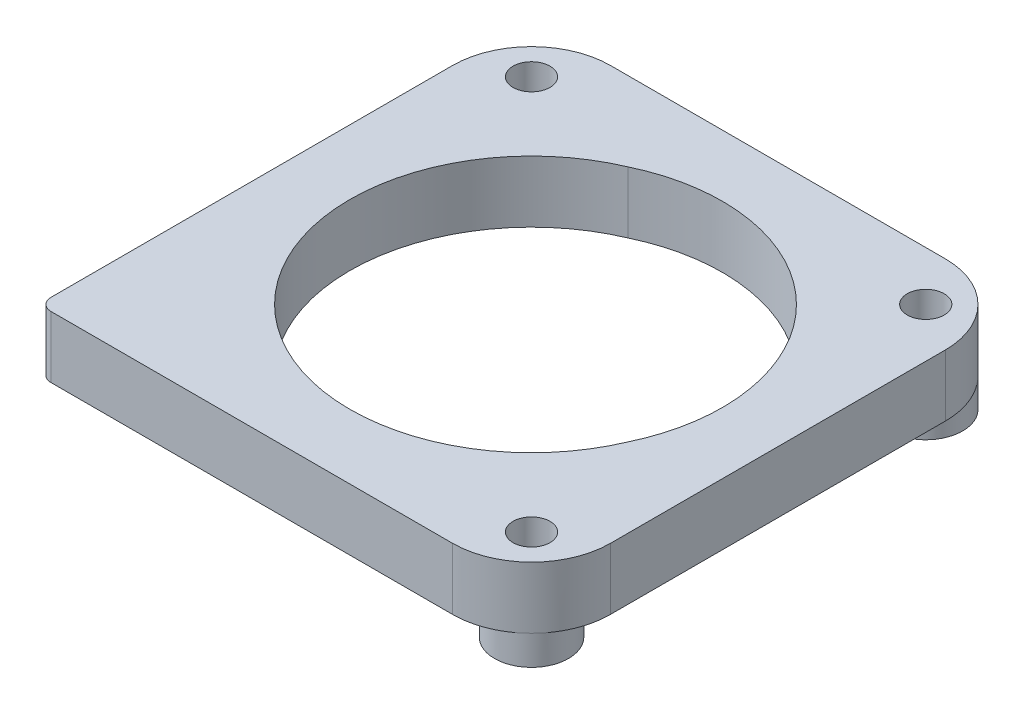
ISO-10303-21;
HEADER;
FILE_DESCRIPTION(('STEP AP214'),'2;1');
FILE_NAME('part.step','',(''),(''),'','','');
FILE_SCHEMA(('AUTOMOTIVE_DESIGN { 1 0 10303 214 1 1 1 1 }'));
ENDSEC;
DATA;
#1=APPLICATION_CONTEXT('core data for automotive mechanical design processes');
#2=APPLICATION_PROTOCOL_DEFINITION('international standard','automotive_design',2000,#1);
#3=PRODUCT_CONTEXT('',#1,'mechanical');
#4=PRODUCT('Part','Part','',(#3));
#5=PRODUCT_RELATED_PRODUCT_CATEGORY('part','',(#4));
#6=PRODUCT_DEFINITION_FORMATION('','',#4);
#7=PRODUCT_DEFINITION_CONTEXT('part definition',#1,'design');
#8=PRODUCT_DEFINITION('design','',#6,#7);
#9=PRODUCT_DEFINITION_SHAPE('','',#8);
#10=(LENGTH_UNIT() NAMED_UNIT(*) SI_UNIT(.MILLI.,.METRE.));
#11=(NAMED_UNIT(*) PLANE_ANGLE_UNIT() SI_UNIT($,.RADIAN.));
#12=(NAMED_UNIT(*) SI_UNIT($,.STERADIAN.) SOLID_ANGLE_UNIT());
#13=UNCERTAINTY_MEASURE_WITH_UNIT(LENGTH_MEASURE(1.E-05),#10,'distance_accuracy_value','');
#14=(GEOMETRIC_REPRESENTATION_CONTEXT(3) GLOBAL_UNCERTAINTY_ASSIGNED_CONTEXT((#13)) GLOBAL_UNIT_ASSIGNED_CONTEXT((#10,
#11,#12)) REPRESENTATION_CONTEXT('',''));
#15=CARTESIAN_POINT('',(0.,0.,0.));
#16=DIRECTION('',(0.,0.,1.));
#17=DIRECTION('',(1.,0.,0.));
#18=AXIS2_PLACEMENT_3D('',#15,#16,#17);
#19=CARTESIAN_POINT('',(0.500000000000007,20.,-0.5));
#20=DIRECTION('',(0.,-1.,0.));
#21=DIRECTION('',(0.,0.,-1.));
#22=AXIS2_PLACEMENT_3D('',#19,#20,#21);
#23=CYLINDRICAL_SURFACE('',#22,14.5);
#24=CARTESIAN_POINT('',(0.500000000000007,15.,-0.5));
#25=DIRECTION('',(0.,1.,0.));
#26=DIRECTION('',(0.,0.,1.));
#27=AXIS2_PLACEMENT_3D('',#24,#25,#26);
#28=CIRCLE('',#27,14.5);
#29=CARTESIAN_POINT('',(13.5769511605932,15.,5.76445116059336));
#30=VERTEX_POINT('',#29);
#31=CARTESIAN_POINT('',(-5.76445116059317,15.,-13.5769511605933));
#32=VERTEX_POINT('',#31);
#33=EDGE_CURVE('E197',#30,#32,#28,.T.);
#34=ORIENTED_EDGE('',*,*,#33,.F.);
#35=DIRECTION('',(0.,-1.,0.));
#36=VECTOR('',#35,1.);
#37=CARTESIAN_POINT('',(13.5769511605932,20.,5.76445116059336));
#38=LINE('',#37,#36);
#39=CARTESIAN_POINT('',(13.5769511605932,20.,5.76445116059336));
#40=VERTEX_POINT('',#39);
#41=EDGE_CURVE('E11',#40,#30,#38,.T.);
#42=ORIENTED_EDGE('',*,*,#41,.F.);
#43=CARTESIAN_POINT('',(0.500000000000007,20.,-0.5));
#44=DIRECTION('',(0.,1.,0.));
#45=DIRECTION('',(0.,0.,1.));
#46=AXIS2_PLACEMENT_3D('',#43,#44,#45);
#47=CIRCLE('',#46,14.5);
#48=CARTESIAN_POINT('',(-5.76445116059317,20.,-13.5769511605933));
#49=VERTEX_POINT('',#48);
#50=EDGE_CURVE('E161',#40,#49,#47,.T.);
#51=ORIENTED_EDGE('',*,*,#50,.T.);
#52=DIRECTION('',(0.,-1.,0.));
#53=VECTOR('',#52,1.);
#54=CARTESIAN_POINT('',(-5.76445116059317,20.,-13.5769511605933));
#55=LINE('',#54,#53);
#56=EDGE_CURVE('E57',#49,#32,#55,.T.);
#57=ORIENTED_EDGE('',*,*,#56,.T.);
#58=EDGE_LOOP('',(#34,#42,#51,#57));
#59=FACE_BOUND('',#58,.T.);
#60=ADVANCED_FACE('F47',(#59),#23,.F.);
#61=CARTESIAN_POINT('',(0.,20.,-20.));
#62=DIRECTION('',(0.,0.,1.));
#63=DIRECTION('',(1.,0.,0.));
#64=AXIS2_PLACEMENT_3D('',#61,#62,#63);
#65=PLANE('',#64);
#66=DIRECTION('',(-1.,0.,0.));
#67=VECTOR('',#66,1.);
#68=CARTESIAN_POINT('',(0.,15.,-20.));
#69=LINE('',#68,#67);
#70=CARTESIAN_POINT('',(13.5857864376269,15.,-20.));
#71=VERTEX_POINT('',#70);
#72=CARTESIAN_POINT('',(-13.5857864376269,15.,-20.));
#73=VERTEX_POINT('',#72);
#74=EDGE_CURVE('E174',#71,#73,#69,.T.);
#75=ORIENTED_EDGE('',*,*,#74,.T.);
#76=DIRECTION('',(0.,-1.,0.));
#77=VECTOR('',#76,1.);
#78=CARTESIAN_POINT('',(-13.5857864376269,20.,-20.));
#79=LINE('',#78,#77);
#80=CARTESIAN_POINT('',(-13.5857864376269,20.,-20.));
#81=VERTEX_POINT('',#80);
#82=EDGE_CURVE('E51',#81,#73,#79,.T.);
#83=ORIENTED_EDGE('',*,*,#82,.F.);
#84=DIRECTION('',(-1.,0.,0.));
#85=VECTOR('',#84,1.);
#86=CARTESIAN_POINT('',(0.,20.,-20.));
#87=LINE('',#86,#85);
#88=CARTESIAN_POINT('',(13.5857864376269,20.,-20.));
#89=VERTEX_POINT('',#88);
#90=EDGE_CURVE('E112',#89,#81,#87,.T.);
#91=ORIENTED_EDGE('',*,*,#90,.F.);
#92=DIRECTION('',(0.,-1.,0.));
#93=VECTOR('',#92,1.);
#94=CARTESIAN_POINT('',(13.5857864376269,20.,-20.));
#95=LINE('',#94,#93);
#96=EDGE_CURVE('E137',#89,#71,#95,.T.);
#97=ORIENTED_EDGE('',*,*,#96,.T.);
#98=EDGE_LOOP('',(#75,#83,#91,#97));
#99=FACE_BOUND('',#98,.T.);
#100=ADVANCED_FACE('F150',(#99),#65,.F.);
#101=CARTESIAN_POINT('',(-13.5857864376269,20.,-13.5857864376269));
#102=DIRECTION('',(0.,-1.,0.));
#103=DIRECTION('',(0.,0.,-1.));
#104=AXIS2_PLACEMENT_3D('',#101,#102,#103);
#105=CYLINDRICAL_SURFACE('',#104,6.4142135623731);
#106=CARTESIAN_POINT('',(-13.5857864376269,15.,-13.5857864376269));
#107=DIRECTION('',(0.,1.,0.));
#108=DIRECTION('',(0.,0.,1.));
#109=AXIS2_PLACEMENT_3D('',#106,#107,#108);
#110=CIRCLE('',#109,6.4142135623731);
#111=CARTESIAN_POINT('',(-20.,15.,-13.5857864376269));
#112=VERTEX_POINT('',#111);
#113=CARTESIAN_POINT('',(-18.1213203435596,15.,-18.1213203435596));
#114=VERTEX_POINT('',#113);
#115=EDGE_CURVE('E178',#112,#114,#110,.F.);
#116=ORIENTED_EDGE('',*,*,#115,.F.);
#117=DIRECTION('',(0.,-1.,0.));
#118=VECTOR('',#117,1.);
#119=CARTESIAN_POINT('',(-20.,20.,-13.5857864376269));
#120=LINE('',#119,#118);
#121=CARTESIAN_POINT('',(-20.,20.,-13.5857864376269));
#122=VERTEX_POINT('',#121);
#123=EDGE_CURVE('E214',#122,#112,#120,.T.);
#124=ORIENTED_EDGE('',*,*,#123,.F.);
#125=CARTESIAN_POINT('',(-13.5857864376269,20.,-13.5857864376269));
#126=DIRECTION('',(0.,1.,0.));
#127=DIRECTION('',(0.,0.,1.));
#128=AXIS2_PLACEMENT_3D('',#125,#126,#127);
#129=CIRCLE('',#128,6.4142135623731);
#130=EDGE_CURVE('E153',#122,#81,#129,.F.);
#131=ORIENTED_EDGE('',*,*,#130,.T.);
#132=ORIENTED_EDGE('',*,*,#82,.T.);
#133=EDGE_CURVE('E176',#114,#73,#110,.F.);
#134=ORIENTED_EDGE('',*,*,#133,.F.);
#135=EDGE_LOOP('',(#116,#124,#131,#132,#134));
#136=FACE_BOUND('',#135,.T.);
#137=ADVANCED_FACE('F221',(#136),#105,.T.);
#138=CARTESIAN_POINT('',(-20.,20.,0.));
#139=DIRECTION('',(1.,0.,0.));
#140=DIRECTION('',(0.,0.,-1.));
#141=AXIS2_PLACEMENT_3D('',#138,#139,#140);
#142=PLANE('',#141);
#143=DIRECTION('',(0.,0.,1.));
#144=VECTOR('',#143,1.);
#145=CARTESIAN_POINT('',(-20.,15.,0.));
#146=LINE('',#145,#144);
#147=CARTESIAN_POINT('',(-20.,15.,19.));
#148=VERTEX_POINT('',#147);
#149=EDGE_CURVE('E181',#112,#148,#146,.T.);
#150=ORIENTED_EDGE('',*,*,#149,.T.);
#151=DIRECTION('',(0.,-1.,0.));
#152=VECTOR('',#151,1.);
#153=CARTESIAN_POINT('',(-20.,20.,19.));
#154=LINE('',#153,#152);
#155=CARTESIAN_POINT('',(-20.,20.,19.));
#156=VERTEX_POINT('',#155);
#157=EDGE_CURVE('E212',#156,#148,#154,.T.);
#158=ORIENTED_EDGE('',*,*,#157,.F.);
#159=DIRECTION('',(0.,0.,1.));
#160=VECTOR('',#159,1.);
#161=CARTESIAN_POINT('',(-20.,20.,0.));
#162=LINE('',#161,#160);
#163=EDGE_CURVE('E254',#122,#156,#162,.T.);
#164=ORIENTED_EDGE('',*,*,#163,.F.);
#165=ORIENTED_EDGE('',*,*,#123,.T.);
#166=EDGE_LOOP('',(#150,#158,#164,#165));
#167=FACE_BOUND('',#166,.T.);
#168=ADVANCED_FACE('F316',(#167),#142,.F.);
#169=CARTESIAN_POINT('',(-19.,20.,19.));
#170=DIRECTION('',(0.,-1.,0.));
#171=DIRECTION('',(0.,0.,-1.));
#172=AXIS2_PLACEMENT_3D('',#169,#170,#171);
#173=CYLINDRICAL_SURFACE('',#172,1.);
#174=CARTESIAN_POINT('',(-19.,15.,19.));
#175=DIRECTION('',(0.,1.,0.));
#176=DIRECTION('',(0.,0.,1.));
#177=AXIS2_PLACEMENT_3D('',#174,#175,#176);
#178=CIRCLE('',#177,1.);
#179=CARTESIAN_POINT('',(-19.,15.,20.));
#180=VERTEX_POINT('',#179);
#181=EDGE_CURVE('E183',#148,#180,#178,.T.);
#182=ORIENTED_EDGE('',*,*,#181,.T.);
#183=DIRECTION('',(0.,-1.,0.));
#184=VECTOR('',#183,1.);
#185=CARTESIAN_POINT('',(-19.,20.,20.));
#186=LINE('',#185,#184);
#187=CARTESIAN_POINT('',(-19.,20.,20.));
#188=VERTEX_POINT('',#187);
#189=EDGE_CURVE('E209',#188,#180,#186,.T.);
#190=ORIENTED_EDGE('',*,*,#189,.F.);
#191=CARTESIAN_POINT('',(-19.,20.,19.));
#192=DIRECTION('',(0.,1.,0.));
#193=DIRECTION('',(0.,0.,1.));
#194=AXIS2_PLACEMENT_3D('',#191,#192,#193);
#195=CIRCLE('',#194,1.);
#196=EDGE_CURVE('E256',#156,#188,#195,.T.);
#197=ORIENTED_EDGE('',*,*,#196,.F.);
#198=ORIENTED_EDGE('',*,*,#157,.T.);
#199=EDGE_LOOP('',(#182,#190,#197,#198));
#200=FACE_BOUND('',#199,.T.);
#201=ADVANCED_FACE('F313',(#200),#173,.T.);
#202=CARTESIAN_POINT('',(0.,20.,20.));
#203=DIRECTION('',(0.,0.,-1.));
#204=DIRECTION('',(-1.,0.,0.));
#205=AXIS2_PLACEMENT_3D('',#202,#203,#204);
#206=PLANE('',#205);
#207=DIRECTION('',(1.,0.,0.));
#208=VECTOR('',#207,1.);
#209=CARTESIAN_POINT('',(0.,15.,20.));
#210=LINE('',#209,#208);
#211=CARTESIAN_POINT('',(13.5857864376269,15.,20.));
#212=VERTEX_POINT('',#211);
#213=EDGE_CURVE('E185',#180,#212,#210,.T.);
#214=ORIENTED_EDGE('',*,*,#213,.T.);
#215=DIRECTION('',(0.,-1.,0.));
#216=VECTOR('',#215,1.);
#217=CARTESIAN_POINT('',(13.5857864376269,20.,20.));
#218=LINE('',#217,#216);
#219=CARTESIAN_POINT('',(13.5857864376269,20.,20.));
#220=VERTEX_POINT('',#219);
#221=EDGE_CURVE('E206',#220,#212,#218,.T.);
#222=ORIENTED_EDGE('',*,*,#221,.F.);
#223=DIRECTION('',(1.,0.,0.));
#224=VECTOR('',#223,1.);
#225=CARTESIAN_POINT('',(0.,20.,20.));
#226=LINE('',#225,#224);
#227=EDGE_CURVE('E258',#188,#220,#226,.T.);
#228=ORIENTED_EDGE('',*,*,#227,.F.);
#229=ORIENTED_EDGE('',*,*,#189,.T.);
#230=EDGE_LOOP('',(#214,#222,#228,#229));
#231=FACE_BOUND('',#230,.T.);
#232=ADVANCED_FACE('F269',(#231),#206,.F.);
#233=CARTESIAN_POINT('',(13.5857864376269,20.,13.5857864376269));
#234=DIRECTION('',(0.,-1.,0.));
#235=DIRECTION('',(0.,0.,-1.));
#236=AXIS2_PLACEMENT_3D('',#233,#234,#235);
#237=CYLINDRICAL_SURFACE('',#236,6.41421356237311);
#238=CARTESIAN_POINT('',(13.5857864376269,15.,13.5857864376269));
#239=DIRECTION('',(0.,1.,0.));
#240=DIRECTION('',(0.,0.,1.));
#241=AXIS2_PLACEMENT_3D('',#238,#239,#240);
#242=CIRCLE('',#241,6.41421356237311);
#243=CARTESIAN_POINT('',(20.,15.,13.5857864376269));
#244=VERTEX_POINT('',#243);
#245=CARTESIAN_POINT('',(18.1213203435596,15.,18.1213203435596));
#246=VERTEX_POINT('',#245);
#247=EDGE_CURVE('E189',#244,#246,#242,.F.);
#248=ORIENTED_EDGE('',*,*,#247,.F.);
#249=DIRECTION('',(0.,-1.,0.));
#250=VECTOR('',#249,1.);
#251=CARTESIAN_POINT('',(20.,20.,13.5857864376269));
#252=LINE('',#251,#250);
#253=CARTESIAN_POINT('',(20.,20.,13.5857864376269));
#254=VERTEX_POINT('',#253);
#255=EDGE_CURVE('E204',#254,#244,#252,.T.);
#256=ORIENTED_EDGE('',*,*,#255,.F.);
#257=CARTESIAN_POINT('',(13.5857864376269,20.,13.5857864376269));
#258=DIRECTION('',(0.,1.,0.));
#259=DIRECTION('',(0.,0.,1.));
#260=AXIS2_PLACEMENT_3D('',#257,#258,#259);
#261=CIRCLE('',#260,6.41421356237311);
#262=EDGE_CURVE('E164',#254,#220,#261,.F.);
#263=ORIENTED_EDGE('',*,*,#262,.T.);
#264=ORIENTED_EDGE('',*,*,#221,.T.);
#265=EDGE_CURVE('E188',#246,#212,#242,.F.);
#266=ORIENTED_EDGE('',*,*,#265,.F.);
#267=EDGE_LOOP('',(#248,#256,#263,#264,#266));
#268=FACE_BOUND('',#267,.T.);
#269=ADVANCED_FACE('F262',(#268),#237,.T.);
#270=CARTESIAN_POINT('',(20.,20.,0.));
#271=DIRECTION('',(-1.,0.,0.));
#272=DIRECTION('',(0.,0.,1.));
#273=AXIS2_PLACEMENT_3D('',#270,#271,#272);
#274=PLANE('',#273);
#275=DIRECTION('',(0.,0.,-1.));
#276=VECTOR('',#275,1.);
#277=CARTESIAN_POINT('',(20.,15.,0.));
#278=LINE('',#277,#276);
#279=CARTESIAN_POINT('',(20.,15.,-13.5857864376269));
#280=VERTEX_POINT('',#279);
#281=EDGE_CURVE('E192',#244,#280,#278,.T.);
#282=ORIENTED_EDGE('',*,*,#281,.T.);
#283=DIRECTION('',(0.,-1.,0.));
#284=VECTOR('',#283,1.);
#285=CARTESIAN_POINT('',(20.,20.,-13.5857864376269));
#286=LINE('',#285,#284);
#287=CARTESIAN_POINT('',(20.,20.,-13.5857864376269));
#288=VERTEX_POINT('',#287);
#289=EDGE_CURVE('E147',#288,#280,#286,.T.);
#290=ORIENTED_EDGE('',*,*,#289,.F.);
#291=DIRECTION('',(0.,0.,-1.));
#292=VECTOR('',#291,1.);
#293=CARTESIAN_POINT('',(20.,20.,0.));
#294=LINE('',#293,#292);
#295=EDGE_CURVE('E159',#254,#288,#294,.T.);
#296=ORIENTED_EDGE('',*,*,#295,.F.);
#297=ORIENTED_EDGE('',*,*,#255,.T.);
#298=EDGE_LOOP('',(#282,#290,#296,#297));
#299=FACE_BOUND('',#298,.T.);
#300=ADVANCED_FACE('F278',(#299),#274,.F.);
#301=CARTESIAN_POINT('',(16.,20.,16.));
#302=DIRECTION('',(0.,-1.,0.));
#303=DIRECTION('',(0.,0.,-1.));
#304=AXIS2_PLACEMENT_3D('',#301,#302,#303);
#305=CYLINDRICAL_SURFACE('',#304,1.5);
#306=CARTESIAN_POINT('',(16.,20.,16.));
#307=DIRECTION('',(0.,1.,0.));
#308=DIRECTION('',(0.,0.,1.));
#309=AXIS2_PLACEMENT_3D('',#306,#307,#308);
#310=CIRCLE('',#309,1.5);
#311=CARTESIAN_POINT('',(16.,20.,17.5));
#312=VERTEX_POINT('',#311);
#313=EDGE_CURVE('E169',#312,#312,#310,.T.);
#314=ORIENTED_EDGE('',*,*,#313,.T.);
#315=EDGE_LOOP('',(#314));
#316=FACE_BOUND('',#315,.T.);
#317=CARTESIAN_POINT('',(16.,12.6,16.));
#318=DIRECTION('',(0.,1.,0.));
#319=DIRECTION('',(0.,0.,1.));
#320=AXIS2_PLACEMENT_3D('',#317,#318,#319);
#321=CIRCLE('',#320,1.5);
#322=CARTESIAN_POINT('',(16.,12.6,17.5));
#323=VERTEX_POINT('',#322);
#324=EDGE_CURVE('E239',#323,#323,#321,.T.);
#325=ORIENTED_EDGE('',*,*,#324,.F.);
#326=EDGE_LOOP('',(#325));
#327=FACE_BOUND('',#326,.T.);
#328=ADVANCED_FACE('F308',(#316,#327),#305,.F.);
#329=CARTESIAN_POINT('',(0.,20.,0.));
#330=DIRECTION('',(0.,-1.,0.));
#331=DIRECTION('',(0.,0.,-1.));
#332=AXIS2_PLACEMENT_3D('',#329,#330,#331);
#333=CYLINDRICAL_SURFACE('',#332,14.75);
#334=CARTESIAN_POINT('',(0.,15.,0.));
#335=DIRECTION('',(0.,1.,0.));
#336=DIRECTION('',(0.,0.,1.));
#337=AXIS2_PLACEMENT_3D('',#334,#335,#336);
#338=CIRCLE('',#337,14.75);
#339=EDGE_CURVE('E200',#30,#32,#338,.F.);
#340=ORIENTED_EDGE('',*,*,#339,.T.);
#341=ORIENTED_EDGE('',*,*,#56,.F.);
#342=CARTESIAN_POINT('',(0.,20.,0.));
#343=DIRECTION('',(0.,1.,0.));
#344=DIRECTION('',(0.,0.,1.));
#345=AXIS2_PLACEMENT_3D('',#342,#343,#344);
#346=CIRCLE('',#345,14.75);
#347=EDGE_CURVE('E65',#40,#49,#346,.F.);
#348=ORIENTED_EDGE('',*,*,#347,.F.);
#349=ORIENTED_EDGE('',*,*,#41,.T.);
#350=EDGE_LOOP('',(#340,#341,#348,#349));
#351=FACE_BOUND('',#350,.T.);
#352=ADVANCED_FACE('F302',(#351),#333,.F.);
#353=CARTESIAN_POINT('',(13.5857864376269,20.,-13.5857864376269));
#354=DIRECTION('',(0.,-1.,0.));
#355=DIRECTION('',(0.,0.,-1.));
#356=AXIS2_PLACEMENT_3D('',#353,#354,#355);
#357=CYLINDRICAL_SURFACE('',#356,6.41421356237313);
#358=CARTESIAN_POINT('',(13.5857864376269,15.,-13.5857864376269));
#359=DIRECTION('',(0.,1.,0.));
#360=DIRECTION('',(0.,0.,1.));
#361=AXIS2_PLACEMENT_3D('',#358,#359,#360);
#362=CIRCLE('',#361,6.41421356237313);
#363=CARTESIAN_POINT('',(18.1213203435596,15.,-18.1213203435596));
#364=VERTEX_POINT('',#363);
#365=EDGE_CURVE('E143',#71,#364,#362,.F.);
#366=ORIENTED_EDGE('',*,*,#365,.F.);
#367=ORIENTED_EDGE('',*,*,#96,.F.);
#368=CARTESIAN_POINT('',(13.5857864376269,20.,-13.5857864376269));
#369=DIRECTION('',(0.,1.,0.));
#370=DIRECTION('',(0.,0.,1.));
#371=AXIS2_PLACEMENT_3D('',#368,#369,#370);
#372=CIRCLE('',#371,6.41421356237313);
#373=EDGE_CURVE('E140',#89,#288,#372,.F.);
#374=ORIENTED_EDGE('',*,*,#373,.T.);
#375=ORIENTED_EDGE('',*,*,#289,.T.);
#376=EDGE_CURVE('E195',#364,#280,#362,.F.);
#377=ORIENTED_EDGE('',*,*,#376,.F.);
#378=EDGE_LOOP('',(#366,#367,#374,#375,#377));
#379=FACE_BOUND('',#378,.T.);
#380=ADVANCED_FACE('F138',(#379),#357,.T.);
#381=CARTESIAN_POINT('',(-16.,20.,-16.));
#382=DIRECTION('',(0.,-1.,0.));
#383=DIRECTION('',(0.,0.,-1.));
#384=AXIS2_PLACEMENT_3D('',#381,#382,#383);
#385=CYLINDRICAL_SURFACE('',#384,1.5);
#386=CARTESIAN_POINT('',(-16.,20.,-16.));
#387=DIRECTION('',(0.,1.,0.));
#388=DIRECTION('',(0.,0.,1.));
#389=AXIS2_PLACEMENT_3D('',#386,#387,#388);
#390=CIRCLE('',#389,1.5);
#391=CARTESIAN_POINT('',(-16.,20.,-14.5));
#392=VERTEX_POINT('',#391);
#393=EDGE_CURVE('E154',#392,#392,#390,.T.);
#394=ORIENTED_EDGE('',*,*,#393,.T.);
#395=EDGE_LOOP('',(#394));
#396=FACE_BOUND('',#395,.T.);
#397=CARTESIAN_POINT('',(-16.,12.6,-16.));
#398=DIRECTION('',(0.,1.,0.));
#399=DIRECTION('',(0.,0.,1.));
#400=AXIS2_PLACEMENT_3D('',#397,#398,#399);
#401=CIRCLE('',#400,1.5);
#402=CARTESIAN_POINT('',(-16.,12.6,-14.5));
#403=VERTEX_POINT('',#402);
#404=EDGE_CURVE('E232',#403,#403,#401,.T.);
#405=ORIENTED_EDGE('',*,*,#404,.F.);
#406=EDGE_LOOP('',(#405));
#407=FACE_BOUND('',#406,.T.);
#408=ADVANCED_FACE('F49',(#396,#407),#385,.F.);
#409=CARTESIAN_POINT('',(16.,20.,-16.));
#410=DIRECTION('',(0.,-1.,0.));
#411=DIRECTION('',(0.,0.,-1.));
#412=AXIS2_PLACEMENT_3D('',#409,#410,#411);
#413=CYLINDRICAL_SURFACE('',#412,1.5);
#414=CARTESIAN_POINT('',(16.,20.,-16.));
#415=DIRECTION('',(0.,1.,0.));
#416=DIRECTION('',(0.,0.,1.));
#417=AXIS2_PLACEMENT_3D('',#414,#415,#416);
#418=CIRCLE('',#417,1.5);
#419=CARTESIAN_POINT('',(16.,20.,-14.5));
#420=VERTEX_POINT('',#419);
#421=EDGE_CURVE('E148',#420,#420,#418,.T.);
#422=ORIENTED_EDGE('',*,*,#421,.T.);
#423=EDGE_LOOP('',(#422));
#424=FACE_BOUND('',#423,.T.);
#425=CARTESIAN_POINT('',(16.,12.6,-16.));
#426=DIRECTION('',(0.,1.,0.));
#427=DIRECTION('',(0.,0.,1.));
#428=AXIS2_PLACEMENT_3D('',#425,#426,#427);
#429=CIRCLE('',#428,1.5);
#430=CARTESIAN_POINT('',(16.,12.6,-14.5));
#431=VERTEX_POINT('',#430);
#432=EDGE_CURVE('E243',#431,#431,#429,.T.);
#433=ORIENTED_EDGE('',*,*,#432,.F.);
#434=EDGE_LOOP('',(#433));
#435=FACE_BOUND('',#434,.T.);
#436=ADVANCED_FACE('F358',(#424,#435),#413,.F.);
#437=CARTESIAN_POINT('',(0.,20.,0.));
#438=DIRECTION('',(0.,1.,0.));
#439=DIRECTION('',(0.,0.,1.));
#440=AXIS2_PLACEMENT_3D('',#437,#438,#439);
#441=PLANE('',#440);
#442=ORIENTED_EDGE('',*,*,#393,.F.);
#443=EDGE_LOOP('',(#442));
#444=FACE_BOUND('',#443,.T.);
#445=ORIENTED_EDGE('',*,*,#90,.T.);
#446=ORIENTED_EDGE('',*,*,#130,.F.);
#447=ORIENTED_EDGE('',*,*,#163,.T.);
#448=ORIENTED_EDGE('',*,*,#196,.T.);
#449=ORIENTED_EDGE('',*,*,#227,.T.);
#450=ORIENTED_EDGE('',*,*,#262,.F.);
#451=ORIENTED_EDGE('',*,*,#295,.T.);
#452=ORIENTED_EDGE('',*,*,#373,.F.);
#453=EDGE_LOOP('',(#445,#446,#447,#448,#449,#450,#451,#452));
#454=FACE_BOUND('',#453,.T.);
#455=ORIENTED_EDGE('',*,*,#50,.F.);
#456=ORIENTED_EDGE('',*,*,#347,.T.);
#457=EDGE_LOOP('',(#455,#456));
#458=FACE_BOUND('',#457,.T.);
#459=ORIENTED_EDGE('',*,*,#313,.F.);
#460=EDGE_LOOP('',(#459));
#461=FACE_BOUND('',#460,.T.);
#462=ORIENTED_EDGE('',*,*,#421,.F.);
#463=EDGE_LOOP('',(#462));
#464=FACE_BOUND('',#463,.T.);
#465=ADVANCED_FACE('F156',(#444,#454,#458,#461,#464),#441,.T.);
#466=CARTESIAN_POINT('',(0.,15.,0.));
#467=DIRECTION('',(0.,1.,0.));
#468=DIRECTION('',(0.,0.,1.));
#469=AXIS2_PLACEMENT_3D('',#466,#467,#468);
#470=PLANE('',#469);
#471=ORIENTED_EDGE('',*,*,#247,.T.);
#472=CARTESIAN_POINT('',(16.,15.,16.));
#473=DIRECTION('',(0.,1.,0.));
#474=DIRECTION('',(0.,0.,1.));
#475=AXIS2_PLACEMENT_3D('',#472,#473,#474);
#476=CIRCLE('',#475,3.);
#477=EDGE_CURVE('E274',#246,#246,#476,.F.);
#478=ORIENTED_EDGE('',*,*,#477,.F.);
#479=ORIENTED_EDGE('',*,*,#265,.T.);
#480=ORIENTED_EDGE('',*,*,#213,.F.);
#481=ORIENTED_EDGE('',*,*,#181,.F.);
#482=ORIENTED_EDGE('',*,*,#149,.F.);
#483=ORIENTED_EDGE('',*,*,#115,.T.);
#484=CARTESIAN_POINT('',(-16.,15.,-16.));
#485=DIRECTION('',(0.,1.,0.));
#486=DIRECTION('',(0.,0.,1.));
#487=AXIS2_PLACEMENT_3D('',#484,#485,#486);
#488=CIRCLE('',#487,3.);
#489=EDGE_CURVE('E229',#114,#114,#488,.F.);
#490=ORIENTED_EDGE('',*,*,#489,.F.);
#491=ORIENTED_EDGE('',*,*,#133,.T.);
#492=ORIENTED_EDGE('',*,*,#74,.F.);
#493=ORIENTED_EDGE('',*,*,#365,.T.);
#494=CARTESIAN_POINT('',(16.,15.,-16.));
#495=DIRECTION('',(0.,1.,0.));
#496=DIRECTION('',(0.,0.,1.));
#497=AXIS2_PLACEMENT_3D('',#494,#495,#496);
#498=CIRCLE('',#497,3.);
#499=EDGE_CURVE('E246',#364,#364,#498,.F.);
#500=ORIENTED_EDGE('',*,*,#499,.F.);
#501=ORIENTED_EDGE('',*,*,#376,.T.);
#502=ORIENTED_EDGE('',*,*,#281,.F.);
#503=EDGE_LOOP('',(#471,#478,#479,#480,#481,#482,#483,#490,#491,#492,#493,#500,#501,#502));
#504=FACE_BOUND('',#503,.T.);
#505=ORIENTED_EDGE('',*,*,#33,.T.);
#506=ORIENTED_EDGE('',*,*,#339,.F.);
#507=EDGE_LOOP('',(#505,#506));
#508=FACE_BOUND('',#507,.T.);
#509=ADVANCED_FACE('F225',(#504,#508),#470,.F.);
#510=CARTESIAN_POINT('',(16.,12.6,-16.));
#511=DIRECTION('',(0.,1.,0.));
#512=DIRECTION('',(0.,0.,1.));
#513=AXIS2_PLACEMENT_3D('',#510,#511,#512);
#514=CYLINDRICAL_SURFACE('',#513,3.);
#515=CARTESIAN_POINT('',(16.,12.6,-16.));
#516=DIRECTION('',(0.,1.,0.));
#517=DIRECTION('',(0.,0.,1.));
#518=AXIS2_PLACEMENT_3D('',#515,#516,#517);
#519=CIRCLE('',#518,3.);
#520=CARTESIAN_POINT('',(16.,12.6,-13.));
#521=VERTEX_POINT('',#520);
#522=EDGE_CURVE('E177',#521,#521,#519,.F.);
#523=ORIENTED_EDGE('',*,*,#522,.F.);
#524=EDGE_LOOP('',(#523));
#525=FACE_BOUND('',#524,.T.);
#526=ORIENTED_EDGE('',*,*,#499,.T.);
#527=EDGE_LOOP('',(#526));
#528=FACE_BOUND('',#527,.T.);
#529=ADVANCED_FACE('F280',(#525,#528),#514,.T.);
#530=CARTESIAN_POINT('',(0.,12.6,0.));
#531=DIRECTION('',(0.,1.,0.));
#532=DIRECTION('',(0.,0.,1.));
#533=AXIS2_PLACEMENT_3D('',#530,#531,#532);
#534=PLANE('',#533);
#535=ORIENTED_EDGE('',*,*,#432,.T.);
#536=EDGE_LOOP('',(#535));
#537=FACE_BOUND('',#536,.T.);
#538=ORIENTED_EDGE('',*,*,#522,.T.);
#539=EDGE_LOOP('',(#538));
#540=FACE_BOUND('',#539,.T.);
#541=ADVANCED_FACE('F282',(#537,#540),#534,.F.);
#542=CARTESIAN_POINT('',(-16.,12.6,-16.));
#543=DIRECTION('',(0.,1.,0.));
#544=DIRECTION('',(0.,0.,1.));
#545=AXIS2_PLACEMENT_3D('',#542,#543,#544);
#546=CYLINDRICAL_SURFACE('',#545,3.);
#547=CARTESIAN_POINT('',(-16.,12.6,-16.));
#548=DIRECTION('',(0.,1.,0.));
#549=DIRECTION('',(0.,0.,1.));
#550=AXIS2_PLACEMENT_3D('',#547,#548,#549);
#551=CIRCLE('',#550,3.);
#552=CARTESIAN_POINT('',(-16.,12.6,-13.));
#553=VERTEX_POINT('',#552);
#554=EDGE_CURVE('E236',#553,#553,#551,.F.);
#555=ORIENTED_EDGE('',*,*,#554,.F.);
#556=EDGE_LOOP('',(#555));
#557=FACE_BOUND('',#556,.T.);
#558=ORIENTED_EDGE('',*,*,#489,.T.);
#559=EDGE_LOOP('',(#558));
#560=FACE_BOUND('',#559,.T.);
#561=ADVANCED_FACE('F289',(#557,#560),#546,.T.);
#562=CARTESIAN_POINT('',(0.,12.6,0.));
#563=DIRECTION('',(0.,1.,0.));
#564=DIRECTION('',(0.,0.,1.));
#565=AXIS2_PLACEMENT_3D('',#562,#563,#564);
#566=PLANE('',#565);
#567=ORIENTED_EDGE('',*,*,#404,.T.);
#568=EDGE_LOOP('',(#567));
#569=FACE_BOUND('',#568,.T.);
#570=ORIENTED_EDGE('',*,*,#554,.T.);
#571=EDGE_LOOP('',(#570));
#572=FACE_BOUND('',#571,.T.);
#573=ADVANCED_FACE('F481',(#569,#572),#566,.F.);
#574=CARTESIAN_POINT('',(16.,12.6,16.));
#575=DIRECTION('',(0.,1.,0.));
#576=DIRECTION('',(0.,0.,1.));
#577=AXIS2_PLACEMENT_3D('',#574,#575,#576);
#578=CYLINDRICAL_SURFACE('',#577,3.);
#579=CARTESIAN_POINT('',(16.,12.6,16.));
#580=DIRECTION('',(0.,1.,0.));
#581=DIRECTION('',(0.,0.,1.));
#582=AXIS2_PLACEMENT_3D('',#579,#580,#581);
#583=CIRCLE('',#582,3.);
#584=CARTESIAN_POINT('',(16.,12.6,19.));
#585=VERTEX_POINT('',#584);
#586=EDGE_CURVE('E233',#585,#585,#583,.F.);
#587=ORIENTED_EDGE('',*,*,#586,.F.);
#588=EDGE_LOOP('',(#587));
#589=FACE_BOUND('',#588,.T.);
#590=ORIENTED_EDGE('',*,*,#477,.T.);
#591=EDGE_LOOP('',(#590));
#592=FACE_BOUND('',#591,.T.);
#593=ADVANCED_FACE('F478',(#589,#592),#578,.T.);
#594=CARTESIAN_POINT('',(0.,12.6,0.));
#595=DIRECTION('',(0.,1.,0.));
#596=DIRECTION('',(0.,0.,1.));
#597=AXIS2_PLACEMENT_3D('',#594,#595,#596);
#598=PLANE('',#597);
#599=ORIENTED_EDGE('',*,*,#324,.T.);
#600=EDGE_LOOP('',(#599));
#601=FACE_BOUND('',#600,.T.);
#602=ORIENTED_EDGE('',*,*,#586,.T.);
#603=EDGE_LOOP('',(#602));
#604=FACE_BOUND('',#603,.T.);
#605=ADVANCED_FACE('F480',(#601,#604),#598,.F.);
#606=CLOSED_SHELL('',(#60,#100,#137,#168,#201,#232,#269,#300,#328,#352,#380,#408,#436,#465,#509,
#529,#541,#561,#573,#593,#605));
#607=MANIFOLD_SOLID_BREP('B2',#606);
#608=ADVANCED_BREP_SHAPE_REPRESENTATION('',(#18,#607),#14);
#609=SHAPE_DEFINITION_REPRESENTATION(#9,#608);
ENDSEC;
END-ISO-10303-21;
